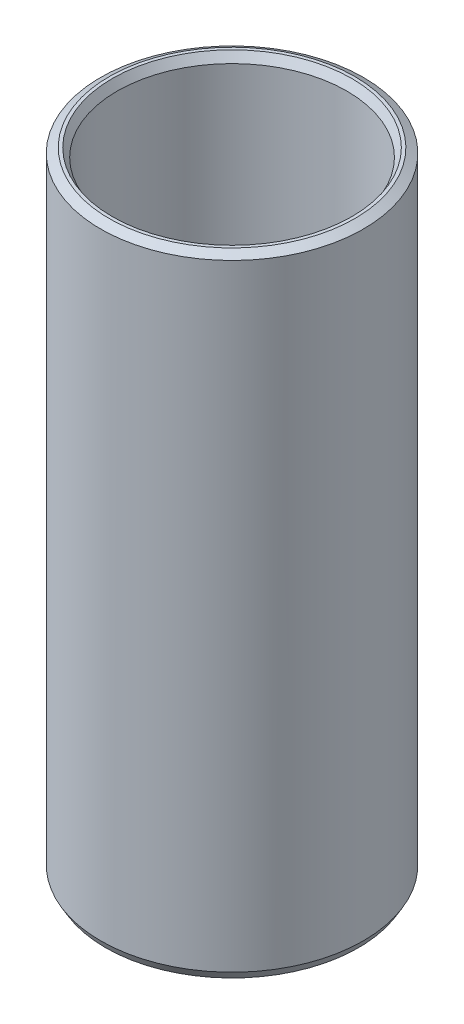
ISO-10303-21;
HEADER;
FILE_DESCRIPTION(('STEP AP214'),'2;1');
FILE_NAME('part.step','',(''),(''),'','','');
FILE_SCHEMA(('AUTOMOTIVE_DESIGN { 1 0 10303 214 1 1 1 1 }'));
ENDSEC;
DATA;
#1=APPLICATION_CONTEXT('core data for automotive mechanical design processes');
#2=APPLICATION_PROTOCOL_DEFINITION('international standard','automotive_design',2000,#1);
#3=PRODUCT_CONTEXT('',#1,'mechanical');
#4=PRODUCT('Part','Part','',(#3));
#5=PRODUCT_RELATED_PRODUCT_CATEGORY('part','',(#4));
#6=PRODUCT_DEFINITION_FORMATION('','',#4);
#7=PRODUCT_DEFINITION_CONTEXT('part definition',#1,'design');
#8=PRODUCT_DEFINITION('design','',#6,#7);
#9=PRODUCT_DEFINITION_SHAPE('','',#8);
#10=(LENGTH_UNIT() NAMED_UNIT(*) SI_UNIT(.MILLI.,.METRE.));
#11=(NAMED_UNIT(*) PLANE_ANGLE_UNIT() SI_UNIT($,.RADIAN.));
#12=(NAMED_UNIT(*) SI_UNIT($,.STERADIAN.) SOLID_ANGLE_UNIT());
#13=UNCERTAINTY_MEASURE_WITH_UNIT(LENGTH_MEASURE(1.E-05),#10,'distance_accuracy_value','');
#14=(GEOMETRIC_REPRESENTATION_CONTEXT(3) GLOBAL_UNCERTAINTY_ASSIGNED_CONTEXT((#13)) GLOBAL_UNIT_ASSIGNED_CONTEXT((#10,
#11,#12)) REPRESENTATION_CONTEXT('',''));
#15=CARTESIAN_POINT('',(0.,0.,0.));
#16=DIRECTION('',(0.,0.,1.));
#17=DIRECTION('',(1.,0.,0.));
#18=AXIS2_PLACEMENT_3D('',#15,#16,#17);
#19=CARTESIAN_POINT('',(0.,179.743611509271,0.));
#20=DIRECTION('',(0.,-1.,0.));
#21=DIRECTION('',(0.,0.,-1.));
#22=AXIS2_PLACEMENT_3D('',#19,#20,#21);
#23=CYLINDRICAL_SURFACE('',#22,37.5);
#24=CARTESIAN_POINT('',(0.,2.41487423217071,0.));
#25=DIRECTION('',(0.,1.,0.));
#26=DIRECTION('',(0.,0.,1.));
#27=AXIS2_PLACEMENT_3D('',#24,#25,#26);
#28=CIRCLE('',#27,37.5);
#29=CARTESIAN_POINT('',(0.,2.41487423217068,-37.5));
#30=VERTEX_POINT('',#29);
#31=EDGE_CURVE('E10',#30,#30,#28,.T.);
#32=CARTESIAN_POINT('',(0.,178.349383221268,0.));
#33=DIRECTION('',(0.,1.,0.));
#34=DIRECTION('',(0.,0.,1.));
#35=AXIS2_PLACEMENT_3D('',#32,#33,#34);
#36=CIRCLE('',#35,37.5);
#37=CARTESIAN_POINT('',(0.,178.349383221268,-37.5));
#38=VERTEX_POINT('',#37);
#39=EDGE_CURVE('E50',#38,#38,#36,.F.);
#40=CARTESIAN_POINT('',(0.,2.41487423217068,-37.5));
#41=CARTESIAN_POINT('',(0.,4.24752536747379,-37.5));
#42=CARTESIAN_POINT('',(0.,6.08017650277689,-37.5));
#43=CARTESIAN_POINT('',(0.,9.74547877338309,-37.5));
#44=CARTESIAN_POINT('',(0.,11.5781299086862,-37.5));
#45=CARTESIAN_POINT('',(0.,15.2434321792924,-37.5));
#46=CARTESIAN_POINT('',(0.,17.0760833145955,-37.5));
#47=CARTESIAN_POINT('',(0.,20.7413855852017,-37.5));
#48=CARTESIAN_POINT('',(0.,22.5740367205048,-37.5));
#49=CARTESIAN_POINT('',(0.,26.239338991111,-37.5));
#50=CARTESIAN_POINT('',(0.,28.0719901264141,-37.5));
#51=CARTESIAN_POINT('',(0.,31.7372923970203,-37.5));
#52=CARTESIAN_POINT('',(0.,33.5699435323234,-37.5));
#53=CARTESIAN_POINT('',(0.,37.2352458029296,-37.5));
#54=CARTESIAN_POINT('',(0.,39.0678969382327,-37.5));
#55=CARTESIAN_POINT('',(0.,42.7331992088389,-37.5));
#56=CARTESIAN_POINT('',(0.,44.565850344142,-37.5));
#57=CARTESIAN_POINT('',(0.,48.2311526147482,-37.5));
#58=CARTESIAN_POINT('',(0.,50.0638037500513,-37.5));
#59=CARTESIAN_POINT('',(0.,53.7291060206575,-37.5));
#60=CARTESIAN_POINT('',(0.,55.5617571559606,-37.5));
#61=CARTESIAN_POINT('',(0.,59.2270594265668,-37.5));
#62=CARTESIAN_POINT('',(0.,61.0597105618699,-37.5));
#63=CARTESIAN_POINT('',(0.,64.7250128324761,-37.5));
#64=CARTESIAN_POINT('',(0.,66.5576639677792,-37.5));
#65=CARTESIAN_POINT('',(0.,70.2229662383854,-37.5));
#66=CARTESIAN_POINT('',(0.,72.0556173736885,-37.5));
#67=CARTESIAN_POINT('',(0.,75.7209196442947,-37.5));
#68=CARTESIAN_POINT('',(0.,77.5535707795978,-37.5));
#69=CARTESIAN_POINT('',(0.,81.218873050204,-37.5));
#70=CARTESIAN_POINT('',(0.,83.0515241855071,-37.5));
#71=CARTESIAN_POINT('',(0.,86.7168264561133,-37.5));
#72=CARTESIAN_POINT('',(0.,88.5494775914164,-37.5));
#73=CARTESIAN_POINT('',(0.,92.2147798620226,-37.5));
#74=CARTESIAN_POINT('',(0.,94.0474309973257,-37.5));
#75=CARTESIAN_POINT('',(0.,97.712733267932,-37.5));
#76=CARTESIAN_POINT('',(0.,99.545384403235,-37.5));
#77=CARTESIAN_POINT('',(0.,103.210686673841,-37.5));
#78=CARTESIAN_POINT('',(0.,105.043337809144,-37.5));
#79=CARTESIAN_POINT('',(0.,108.708640079751,-37.5));
#80=CARTESIAN_POINT('',(0.,110.541291215054,-37.5));
#81=CARTESIAN_POINT('',(0.,114.20659348566,-37.5));
#82=CARTESIAN_POINT('',(0.,116.039244620963,-37.5));
#83=CARTESIAN_POINT('',(0.,119.704546891569,-37.5));
#84=CARTESIAN_POINT('',(0.,121.537198026872,-37.5));
#85=CARTESIAN_POINT('',(0.,125.202500297478,-37.5));
#86=CARTESIAN_POINT('',(0.,127.035151432782,-37.5));
#87=CARTESIAN_POINT('',(0.,130.700453703388,-37.5));
#88=CARTESIAN_POINT('',(0.,132.533104838691,-37.5));
#89=CARTESIAN_POINT('',(0.,136.198407109297,-37.5));
#90=CARTESIAN_POINT('',(0.,138.0310582446,-37.5));
#91=CARTESIAN_POINT('',(0.,141.696360515206,-37.5));
#92=CARTESIAN_POINT('',(0.,143.529011650509,-37.5));
#93=CARTESIAN_POINT('',(0.,147.194313921116,-37.5));
#94=CARTESIAN_POINT('',(0.,149.026965056419,-37.5));
#95=CARTESIAN_POINT('',(0.,152.692267327025,-37.5));
#96=CARTESIAN_POINT('',(0.,154.524918462328,-37.5));
#97=CARTESIAN_POINT('',(0.,158.190220732934,-37.5));
#98=CARTESIAN_POINT('',(0.,160.022871868237,-37.5));
#99=CARTESIAN_POINT('',(0.,163.688174138844,-37.5));
#100=CARTESIAN_POINT('',(0.,165.520825274147,-37.5));
#101=CARTESIAN_POINT('',(0.,169.186127544753,-37.5));
#102=CARTESIAN_POINT('',(0.,171.018778680056,-37.5));
#103=CARTESIAN_POINT('',(0.,174.684080950662,-37.5));
#104=CARTESIAN_POINT('',(0.,176.516732085965,-37.5));
#105=CARTESIAN_POINT('',(0.,178.349383221268,-37.5));
#106=B_SPLINE_CURVE_WITH_KNOTS('',3,(#40,#41,#42,#43,#44,#45,#46,#47,#48,#49,#50,#51,#52,#53,
#54,#55,#56,#57,#58,#59,#60,#61,#62,#63,#64,#65,#66,#67,#68,#69,#70,#71,#72,#73,#74,#75,#76,#77,
#78,#79,#80,#81,#82,#83,#84,#85,#86,#87,#88,#89,#90,#91,#92,#93,#94,#95,#96,#97,#98,#99,#100,
#101,#102,#103,#104,#105),.UNSPECIFIED.,.F.,.F.,(4,2,2,2,2,2,2,2,2,2,2,2,2,2,2,2,2,2,2,2,2,2,2,
2,2,2,2,2,2,2,2,2,4),(0.,5.49795340590931,10.9959068118186,16.4938602177279,21.9918136236372,
27.4897670295465,32.9877204354558,38.4856738413651,43.9836272472744,49.4815806531838,
54.979534059093,60.4774874650023,65.9754408709116,71.4733942768209,76.9713476827302,
82.4693010886396,87.9672544945489,93.4652079004582,98.9631613063675,104.461114712277,
109.959068118186,115.457021524095,120.954974930005,126.452928335914,131.950881741823,
137.448835147733,142.946788553642,148.444741959551,153.94269536546,159.44064877137,
164.938602177279,170.436555583188,175.934508989098),.UNSPECIFIED.);
#107=EDGE_CURVE('BSEAM39',#30,#38,#106,.T.);
#108=ORIENTED_EDGE('',*,*,#31,.T.);
#109=ORIENTED_EDGE('',*,*,#39,.T.);
#110=ORIENTED_EDGE('',*,*,#107,.T.);
#111=ORIENTED_EDGE('',*,*,#107,.F.);
#112=EDGE_LOOP('',(#108,#110,#109,#111));
#113=FACE_BOUND('',#112,.T.);
#114=ADVANCED_FACE('F39',(#113),#23,.T.);
#115=CARTESIAN_POINT('',(0.,179.743611509271,0.));
#116=DIRECTION('',(0.,1.,0.));
#117=DIRECTION('',(0.,0.,1.));
#118=AXIS2_PLACEMENT_3D('',#115,#116,#117);
#119=PLANE('',#118);
#120=CARTESIAN_POINT('',(0.,179.743611509271,0.));
#121=DIRECTION('',(0.,1.,0.));
#122=DIRECTION('',(0.,0.,1.));
#123=AXIS2_PLACEMENT_3D('',#120,#121,#122);
#124=CIRCLE('',#123,34.17313921492);
#125=CARTESIAN_POINT('',(0.,179.743611509271,34.17313921492));
#126=VERTEX_POINT('',#125);
#127=EDGE_CURVE('E58',#126,#126,#124,.F.);
#128=ORIENTED_EDGE('',*,*,#127,.T.);
#129=EDGE_LOOP('',(#128));
#130=FACE_BOUND('',#129,.T.);
#131=CARTESIAN_POINT('',(0.,179.743611509271,0.));
#132=DIRECTION('',(0.,1.,0.));
#133=DIRECTION('',(0.,0.,1.));
#134=AXIS2_PLACEMENT_3D('',#131,#132,#133);
#135=CIRCLE('',#134,35.0851257678299);
#136=CARTESIAN_POINT('',(0.,179.743611509271,-35.0851257678299));
#137=VERTEX_POINT('',#136);
#138=EDGE_CURVE('E61',#137,#137,#135,.T.);
#139=ORIENTED_EDGE('',*,*,#138,.T.);
#140=EDGE_LOOP('',(#139));
#141=FACE_BOUND('',#140,.T.);
#142=ADVANCED_FACE('F88',(#130,#141),#119,.T.);
#143=CARTESIAN_POINT('',(0.,0.,0.));
#144=DIRECTION('',(0.,1.,0.));
#145=DIRECTION('',(0.,0.,1.));
#146=AXIS2_PLACEMENT_3D('',#143,#144,#145);
#147=PLANE('',#146);
#148=CARTESIAN_POINT('',(0.,0.,0.));
#149=DIRECTION('',(0.,1.,0.));
#150=DIRECTION('',(0.,0.,1.));
#151=AXIS2_PLACEMENT_3D('',#148,#149,#150);
#152=CIRCLE('',#151,35.1937851590874);
#153=CARTESIAN_POINT('',(0.,0.,35.1937851590874));
#154=VERTEX_POINT('',#153);
#155=EDGE_CURVE('E51',#154,#154,#152,.T.);
#156=ORIENTED_EDGE('',*,*,#155,.T.);
#157=EDGE_LOOP('',(#156));
#158=FACE_BOUND('',#157,.T.);
#159=CARTESIAN_POINT('',(0.,0.,0.));
#160=DIRECTION('',(0.,1.,0.));
#161=DIRECTION('',(0.,0.,1.));
#162=AXIS2_PLACEMENT_3D('',#159,#160,#161);
#163=CIRCLE('',#162,36.1057717119971);
#164=CARTESIAN_POINT('',(0.,0.,36.1057717119971));
#165=VERTEX_POINT('',#164);
#166=EDGE_CURVE('E54',#165,#165,#163,.F.);
#167=ORIENTED_EDGE('',*,*,#166,.T.);
#168=EDGE_LOOP('',(#167));
#169=FACE_BOUND('',#168,.T.);
#170=ADVANCED_FACE('F83',(#158,#169),#147,.F.);
#171=CARTESIAN_POINT('',(0.,179.743611509271,0.));
#172=DIRECTION('',(0.,-1.,0.));
#173=DIRECTION('',(0.,0.,-1.));
#174=AXIS2_PLACEMENT_3D('',#171,#172,#173);
#175=CYLINDRICAL_SURFACE('',#174,32.7789109269172);
#176=CARTESIAN_POINT('',(0.,177.3287372771,0.));
#177=DIRECTION('',(0.,1.,0.));
#178=DIRECTION('',(0.,0.,1.));
#179=AXIS2_PLACEMENT_3D('',#176,#177,#178);
#180=CIRCLE('',#179,32.7789109269172);
#181=CARTESIAN_POINT('',(0.,177.3287372771,-32.7789109269172));
#182=VERTEX_POINT('',#181);
#183=EDGE_CURVE('E67',#182,#182,#180,.T.);
#184=CARTESIAN_POINT('',(0.,1.39422828800259,0.));
#185=DIRECTION('',(0.,1.,0.));
#186=DIRECTION('',(0.,0.,1.));
#187=AXIS2_PLACEMENT_3D('',#184,#185,#186);
#188=CIRCLE('',#187,32.7789109269172);
#189=CARTESIAN_POINT('',(0.,1.39422828800256,-32.7789109269172));
#190=VERTEX_POINT('',#189);
#191=EDGE_CURVE('E69',#190,#190,#188,.F.);
#192=CARTESIAN_POINT('',(0.,177.3287372771,-32.7789109269172));
#193=CARTESIAN_POINT('',(0.,175.496086141797,-32.7789109269172));
#194=CARTESIAN_POINT('',(0.,173.663435006494,-32.7789109269172));
#195=CARTESIAN_POINT('',(0.,169.998132735888,-32.7789109269172));
#196=CARTESIAN_POINT('',(0.,168.165481600585,-32.7789109269172));
#197=CARTESIAN_POINT('',(0.,164.500179329979,-32.7789109269172));
#198=CARTESIAN_POINT('',(0.,162.667528194675,-32.7789109269172));
#199=CARTESIAN_POINT('',(0.,159.002225924069,-32.7789109269172));
#200=CARTESIAN_POINT('',(0.,157.169574788766,-32.7789109269172));
#201=CARTESIAN_POINT('',(0.,153.50427251816,-32.7789109269172));
#202=CARTESIAN_POINT('',(0.,151.671621382857,-32.7789109269172));
#203=CARTESIAN_POINT('',(0.,148.006319112251,-32.7789109269172));
#204=CARTESIAN_POINT('',(0.,146.173667976948,-32.7789109269172));
#205=CARTESIAN_POINT('',(0.,142.508365706341,-32.7789109269172));
#206=CARTESIAN_POINT('',(0.,140.675714571038,-32.7789109269172));
#207=CARTESIAN_POINT('',(0.,137.010412300432,-32.7789109269172));
#208=CARTESIAN_POINT('',(0.,135.177761165129,-32.7789109269172));
#209=CARTESIAN_POINT('',(0.,131.512458894523,-32.7789109269172));
#210=CARTESIAN_POINT('',(0.,129.67980775922,-32.7789109269172));
#211=CARTESIAN_POINT('',(0.,126.014505488613,-32.7789109269172));
#212=CARTESIAN_POINT('',(0.,124.18185435331,-32.7789109269172));
#213=CARTESIAN_POINT('',(0.,120.516552082704,-32.7789109269172));
#214=CARTESIAN_POINT('',(0.,118.683900947401,-32.7789109269172));
#215=CARTESIAN_POINT('',(0.,115.018598676795,-32.7789109269172));
#216=CARTESIAN_POINT('',(0.,113.185947541492,-32.7789109269172));
#217=CARTESIAN_POINT('',(0.,109.520645270886,-32.7789109269172));
#218=CARTESIAN_POINT('',(0.,107.687994135582,-32.7789109269172));
#219=CARTESIAN_POINT('',(0.,104.022691864976,-32.7789109269172));
#220=CARTESIAN_POINT('',(0.,102.190040729673,-32.7789109269172));
#221=CARTESIAN_POINT('',(0.,98.5247384590669,-32.7789109269172));
#222=CARTESIAN_POINT('',(0.,96.6920873237638,-32.7789109269172));
#223=CARTESIAN_POINT('',(0.,93.0267850531576,-32.7789109269172));
#224=CARTESIAN_POINT('',(0.,91.1941339178545,-32.7789109269172));
#225=CARTESIAN_POINT('',(0.,87.5288316472483,-32.7789109269172));
#226=CARTESIAN_POINT('',(0.,85.6961805119452,-32.7789109269172));
#227=CARTESIAN_POINT('',(0.,82.030878241339,-32.7789109269172));
#228=CARTESIAN_POINT('',(0.,80.1982271060359,-32.7789109269172));
#229=CARTESIAN_POINT('',(0.,76.5329248354297,-32.7789109269172));
#230=CARTESIAN_POINT('',(0.,74.7002737001266,-32.7789109269172));
#231=CARTESIAN_POINT('',(0.,71.0349714295204,-32.7789109269172));
#232=CARTESIAN_POINT('',(0.,69.2023202942173,-32.7789109269172));
#233=CARTESIAN_POINT('',(0.,65.5370180236111,-32.7789109269172));
#234=CARTESIAN_POINT('',(0.,63.704366888308,-32.7789109269172));
#235=CARTESIAN_POINT('',(0.,60.0390646177018,-32.7789109269172));
#236=CARTESIAN_POINT('',(0.,58.2064134823987,-32.7789109269172));
#237=CARTESIAN_POINT('',(0.,54.5411112117925,-32.7789109269172));
#238=CARTESIAN_POINT('',(0.,52.7084600764894,-32.7789109269172));
#239=CARTESIAN_POINT('',(0.,49.0431578058832,-32.7789109269172));
#240=CARTESIAN_POINT('',(0.,47.2105066705801,-32.7789109269172));
#241=CARTESIAN_POINT('',(0.,43.5452043999739,-32.7789109269172));
#242=CARTESIAN_POINT('',(0.,41.7125532646708,-32.7789109269172));
#243=CARTESIAN_POINT('',(0.,38.0472509940646,-32.7789109269172));
#244=CARTESIAN_POINT('',(0.,36.2145998587615,-32.7789109269172));
#245=CARTESIAN_POINT('',(0.,32.5492975881553,-32.7789109269172));
#246=CARTESIAN_POINT('',(0.,30.7166464528522,-32.7789109269172));
#247=CARTESIAN_POINT('',(0.,27.051344182246,-32.7789109269172));
#248=CARTESIAN_POINT('',(0.,25.2186930469429,-32.7789109269172));
#249=CARTESIAN_POINT('',(0.,21.5533907763367,-32.7789109269172));
#250=CARTESIAN_POINT('',(0.,19.7207396410336,-32.7789109269172));
#251=CARTESIAN_POINT('',(0.,16.0554373704274,-32.7789109269172));
#252=CARTESIAN_POINT('',(0.,14.2227862351243,-32.7789109269172));
#253=CARTESIAN_POINT('',(0.,10.5574839645181,-32.7789109269172));
#254=CARTESIAN_POINT('',(0.,8.72483282921497,-32.7789109269172));
#255=CARTESIAN_POINT('',(0.,5.05953055860877,-32.7789109269172));
#256=CARTESIAN_POINT('',(0.,3.22687942330567,-32.7789109269172));
#257=CARTESIAN_POINT('',(0.,1.39422828800256,-32.7789109269172));
#258=B_SPLINE_CURVE_WITH_KNOTS('',3,(#192,#193,#194,#195,#196,#197,#198,#199,#200,#201,#202,
#203,#204,#205,#206,#207,#208,#209,#210,#211,#212,#213,#214,#215,#216,#217,#218,#219,#220,#221,
#222,#223,#224,#225,#226,#227,#228,#229,#230,#231,#232,#233,#234,#235,#236,#237,#238,#239,#240,
#241,#242,#243,#244,#245,#246,#247,#248,#249,#250,#251,#252,#253,#254,#255,#256,#257),
.UNSPECIFIED.,.F.,.F.,(4,2,2,2,2,2,2,2,2,2,2,2,2,2,2,2,2,2,2,2,2,2,2,2,2,2,2,2,2,2,2,2,4),(0.,
5.49795340590931,10.9959068118186,16.4938602177279,21.9918136236372,27.4897670295465,
32.9877204354558,38.4856738413651,43.9836272472744,49.4815806531838,54.9795340590931,
60.4774874650024,65.9754408709117,71.473394276821,76.9713476827303,82.4693010886396,
87.9672544945489,93.4652079004582,98.9631613063675,104.461114712277,109.959068118186,
115.457021524095,120.954974930005,126.452928335914,131.950881741823,137.448835147733,
142.946788553642,148.444741959551,153.942695365461,159.44064877137,164.938602177279,
170.436555583188,175.934508989098),.UNSPECIFIED.);
#259=EDGE_CURVE('BSEAM71',#182,#190,#258,.T.);
#260=ORIENTED_EDGE('',*,*,#183,.T.);
#261=ORIENTED_EDGE('',*,*,#191,.T.);
#262=ORIENTED_EDGE('',*,*,#259,.T.);
#263=ORIENTED_EDGE('',*,*,#259,.F.);
#264=EDGE_LOOP('',(#260,#262,#261,#263));
#265=FACE_BOUND('',#264,.T.);
#266=ADVANCED_FACE('F71',(#265),#175,.F.);
#267=CARTESIAN_POINT('',(0.,177.3287372771,0.));
#268=DIRECTION('',(0.,1.,0.));
#269=DIRECTION('',(0.,0.,1.));
#270=AXIS2_PLACEMENT_3D('',#267,#268,#269);
#271=CONICAL_SURFACE('',#270,32.7789109269172,0.523598775598296);
#272=ORIENTED_EDGE('',*,*,#127,.F.);
#273=EDGE_LOOP('',(#272));
#274=FACE_BOUND('',#273,.T.);
#275=ORIENTED_EDGE('',*,*,#183,.F.);
#276=EDGE_LOOP('',(#275));
#277=FACE_BOUND('',#276,.T.);
#278=ADVANCED_FACE('F77',(#274,#277),#271,.F.);
#279=CARTESIAN_POINT('',(0.,0.,0.));
#280=DIRECTION('',(0.,-1.,0.));
#281=DIRECTION('',(0.,0.,-1.));
#282=AXIS2_PLACEMENT_3D('',#279,#280,#281);
#283=CONICAL_SURFACE('',#282,35.1937851590874,1.04719755119659);
#284=ORIENTED_EDGE('',*,*,#191,.F.);
#285=EDGE_LOOP('',(#284));
#286=FACE_BOUND('',#285,.T.);
#287=ORIENTED_EDGE('',*,*,#155,.F.);
#288=EDGE_LOOP('',(#287));
#289=FACE_BOUND('',#288,.T.);
#290=ADVANCED_FACE('F73',(#286,#289),#283,.F.);
#291=CARTESIAN_POINT('',(0.,2.41487423217071,0.));
#292=DIRECTION('',(0.,1.,0.));
#293=DIRECTION('',(0.,0.,1.));
#294=AXIS2_PLACEMENT_3D('',#291,#292,#293);
#295=CONICAL_SURFACE('',#294,37.5,0.523598775598305);
#296=ORIENTED_EDGE('',*,*,#166,.F.);
#297=EDGE_LOOP('',(#296));
#298=FACE_BOUND('',#297,.T.);
#299=ORIENTED_EDGE('',*,*,#31,.F.);
#300=EDGE_LOOP('',(#299));
#301=FACE_BOUND('',#300,.T.);
#302=ADVANCED_FACE('F76',(#298,#301),#295,.T.);
#303=CARTESIAN_POINT('',(0.,179.743611509271,0.));
#304=DIRECTION('',(0.,-1.,0.));
#305=DIRECTION('',(0.,0.,-1.));
#306=AXIS2_PLACEMENT_3D('',#303,#304,#305);
#307=CONICAL_SURFACE('',#306,35.0851257678299,1.04719755119659);
#308=CARTESIAN_POINT('',(0.,178.349383221268,-37.5));
#309=CARTESIAN_POINT('',(0.,178.363906432602,-37.4748450600816));
#310=CARTESIAN_POINT('',(0.,178.378429643935,-37.4496901201632));
#311=CARTESIAN_POINT('',(0.,178.407476066602,-37.3993802403263));
#312=CARTESIAN_POINT('',(0.,178.421999277935,-37.3742253004078));
#313=CARTESIAN_POINT('',(0.,178.451045700602,-37.323915420571));
#314=CARTESIAN_POINT('',(0.,178.465568911935,-37.2987604806525));
#315=CARTESIAN_POINT('',(0.,178.494615334602,-37.2484506008157));
#316=CARTESIAN_POINT('',(0.,178.509138545935,-37.2232956608972));
#317=CARTESIAN_POINT('',(0.,178.538184968602,-37.1729857810603));
#318=CARTESIAN_POINT('',(0.,178.552708179935,-37.1478308411419));
#319=CARTESIAN_POINT('',(0.,178.581754602602,-37.097520961305));
#320=CARTESIAN_POINT('',(0.,178.596277813936,-37.0723660213866));
#321=CARTESIAN_POINT('',(0.,178.625324236602,-37.0220561415497));
#322=CARTESIAN_POINT('',(0.,178.639847447936,-36.9969012016312));
#323=CARTESIAN_POINT('',(0.,178.668893870602,-36.9465913217944));
#324=CARTESIAN_POINT('',(0.,178.683417081936,-36.9214363818759));
#325=CARTESIAN_POINT('',(0.,178.712463504602,-36.8711265020391));
#326=CARTESIAN_POINT('',(0.,178.726986715936,-36.8459715621206));
#327=CARTESIAN_POINT('',(0.,178.756033138602,-36.7956616822837));
#328=CARTESIAN_POINT('',(0.,178.770556349936,-36.7705067423653));
#329=CARTESIAN_POINT('',(0.,178.799602772603,-36.7201968625284));
#330=CARTESIAN_POINT('',(0.,178.814125983936,-36.69504192261));
#331=CARTESIAN_POINT('',(0.,178.843172406603,-36.6447320427731));
#332=CARTESIAN_POINT('',(0.,178.857695617936,-36.6195771028547));
#333=CARTESIAN_POINT('',(0.,178.886742040603,-36.5692672230178));
#334=CARTESIAN_POINT('',(0.,178.901265251936,-36.5441122830994));
#335=CARTESIAN_POINT('',(0.,178.930311674603,-36.4938024032625));
#336=CARTESIAN_POINT('',(0.,178.944834885936,-36.468647463344));
#337=CARTESIAN_POINT('',(0.,178.973881308603,-36.4183375835072));
#338=CARTESIAN_POINT('',(0.,178.988404519936,-36.3931826435887));
#339=CARTESIAN_POINT('',(0.,179.017450942603,-36.3428727637518));
#340=CARTESIAN_POINT('',(0.,179.031974153936,-36.3177178238334));
#341=CARTESIAN_POINT('',(0.,179.061020576603,-36.2674079439965));
#342=CARTESIAN_POINT('',(0.,179.075543787936,-36.2422530040781));
#343=CARTESIAN_POINT('',(0.,179.104590210603,-36.1919431242412));
#344=CARTESIAN_POINT('',(0.,179.119113421936,-36.1667881843228));
#345=CARTESIAN_POINT('',(0.,179.148159844603,-36.1164783044859));
#346=CARTESIAN_POINT('',(0.,179.162683055937,-36.0913233645674));
#347=CARTESIAN_POINT('',(0.,179.191729478603,-36.0410134847306));
#348=CARTESIAN_POINT('',(0.,179.206252689937,-36.0158585448121));
#349=CARTESIAN_POINT('',(0.,179.235299112603,-35.9655486649753));
#350=CARTESIAN_POINT('',(0.,179.249822323937,-35.9403937250568));
#351=CARTESIAN_POINT('',(0.,179.278868746603,-35.8900838452199));
#352=CARTESIAN_POINT('',(0.,179.293391957937,-35.8649289053015));
#353=CARTESIAN_POINT('',(0.,179.322438380604,-35.8146190254646));
#354=CARTESIAN_POINT('',(0.,179.336961591937,-35.7894640855462));
#355=CARTESIAN_POINT('',(0.,179.366008014604,-35.7391542057093));
#356=CARTESIAN_POINT('',(0.,179.380531225937,-35.7139992657909));
#357=CARTESIAN_POINT('',(0.,179.409577648604,-35.663689385954));
#358=CARTESIAN_POINT('',(0.,179.424100859937,-35.6385344460356));
#359=CARTESIAN_POINT('',(0.,179.453147282604,-35.5882245661987));
#360=CARTESIAN_POINT('',(0.,179.467670493937,-35.5630696262802));
#361=CARTESIAN_POINT('',(0.,179.496716916604,-35.5127597464434));
#362=CARTESIAN_POINT('',(0.,179.511240127937,-35.4876048065249));
#363=CARTESIAN_POINT('',(0.,179.540286550604,-35.437294926688));
#364=CARTESIAN_POINT('',(0.,179.554809761937,-35.4121399867696));
#365=CARTESIAN_POINT('',(0.,179.583856184604,-35.3618301069327));
#366=CARTESIAN_POINT('',(0.,179.598379395937,-35.3366751670143));
#367=CARTESIAN_POINT('',(0.,179.627425818604,-35.2863652871774));
#368=CARTESIAN_POINT('',(0.,179.641949029937,-35.261210347259));
#369=CARTESIAN_POINT('',(0.,179.670995452604,-35.2109004674221));
#370=CARTESIAN_POINT('',(0.,179.685518663938,-35.1857455275036));
#371=CARTESIAN_POINT('',(0.,179.714565086604,-35.1354356476668));
#372=CARTESIAN_POINT('',(0.,179.729088297938,-35.1102807077483));
#373=CARTESIAN_POINT('',(0.,179.743611509271,-35.0851257678299));
#374=B_SPLINE_CURVE_WITH_KNOTS('',3,(#308,#309,#310,#311,#312,#313,#314,#315,#316,#317,#318,
#319,#320,#321,#322,#323,#324,#325,#326,#327,#328,#329,#330,#331,#332,#333,#334,#335,#336,#337,
#338,#339,#340,#341,#342,#343,#344,#345,#346,#347,#348,#349,#350,#351,#352,#353,#354,#355,#356,
#357,#358,#359,#360,#361,#362,#363,#364,#365,#366,#367,#368,#369,#370,#371,#372,#373),
.UNSPECIFIED.,.F.,.F.,(4,2,2,2,2,2,2,2,2,2,2,2,2,2,2,2,2,2,2,2,2,2,2,2,2,2,2,2,2,2,2,2,4),(0.,
0.0871392680001657,0.174278536000318,0.261417804000483,0.348557072000635,0.435696340000807,
0.522835608000959,0.60997487600111,0.697114144001276,0.784253412001428,0.871392680001593,
0.958531948001745,1.0456712160019,1.13281048400206,1.21994975200221,1.30708902000238,
1.39422828800253,1.48136755600268,1.56850682400285,1.655646092003,1.74278536000317,
1.82992462800332,1.91706389600347,2.00420316400364,2.09134243200379,2.17848170000395,
2.26562096800411,2.35276023600426,2.43989950400442,2.52703877200458,2.61417804000474,
2.7013173080049,2.78845657600507),.UNSPECIFIED.);
#375=EDGE_CURVE('BSEAM45',#38,#137,#374,.T.);
#376=ORIENTED_EDGE('',*,*,#39,.F.);
#377=ORIENTED_EDGE('',*,*,#138,.F.);
#378=ORIENTED_EDGE('',*,*,#375,.T.);
#379=ORIENTED_EDGE('',*,*,#375,.F.);
#380=EDGE_LOOP('',(#376,#378,#377,#379));
#381=FACE_BOUND('',#380,.T.);
#382=ADVANCED_FACE('F45',(#381),#307,.T.);
#383=CLOSED_SHELL('',(#114,#142,#170,#266,#278,#290,#302,#382));
#384=MANIFOLD_SOLID_BREP('B2',#383);
#385=ADVANCED_BREP_SHAPE_REPRESENTATION('',(#18,#384),#14);
#386=SHAPE_DEFINITION_REPRESENTATION(#9,#385);
ENDSEC;
END-ISO-10303-21;
